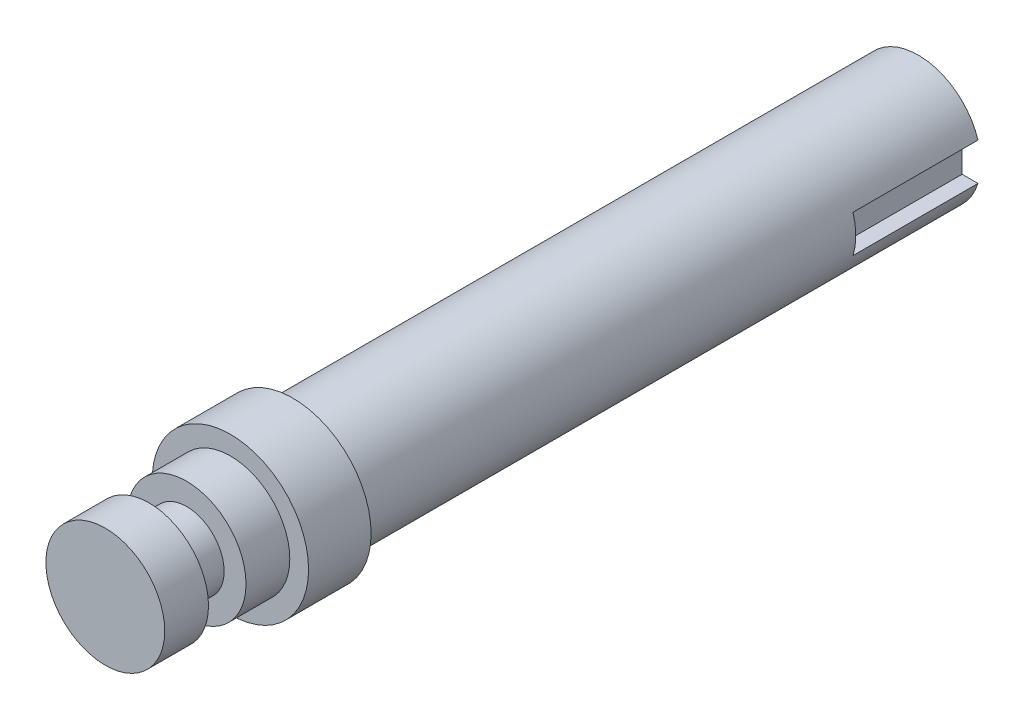
ISO-10303-21;
HEADER;
FILE_DESCRIPTION(('STEP AP214'),'2;1');
FILE_NAME('part.step','',(''),(''),'','','');
FILE_SCHEMA(('AUTOMOTIVE_DESIGN { 1 0 10303 214 1 1 1 1 }'));
ENDSEC;
DATA;
#1=APPLICATION_CONTEXT('core data for automotive mechanical design processes');
#2=APPLICATION_PROTOCOL_DEFINITION('international standard','automotive_design',2000,#1);
#3=PRODUCT_CONTEXT('',#1,'mechanical');
#4=PRODUCT('Part','Part','',(#3));
#5=PRODUCT_RELATED_PRODUCT_CATEGORY('part','',(#4));
#6=PRODUCT_DEFINITION_FORMATION('','',#4);
#7=PRODUCT_DEFINITION_CONTEXT('part definition',#1,'design');
#8=PRODUCT_DEFINITION('design','',#6,#7);
#9=PRODUCT_DEFINITION_SHAPE('','',#8);
#10=(LENGTH_UNIT() NAMED_UNIT(*) SI_UNIT(.MILLI.,.METRE.));
#11=(NAMED_UNIT(*) PLANE_ANGLE_UNIT() SI_UNIT($,.RADIAN.));
#12=(NAMED_UNIT(*) SI_UNIT($,.STERADIAN.) SOLID_ANGLE_UNIT());
#13=UNCERTAINTY_MEASURE_WITH_UNIT(LENGTH_MEASURE(1.E-05),#10,'distance_accuracy_value','');
#14=(GEOMETRIC_REPRESENTATION_CONTEXT(3) GLOBAL_UNCERTAINTY_ASSIGNED_CONTEXT((#13)) GLOBAL_UNIT_ASSIGNED_CONTEXT((#10,
#11,#12)) REPRESENTATION_CONTEXT('',''));
#15=CARTESIAN_POINT('',(0.,0.,0.));
#16=DIRECTION('',(0.,0.,1.));
#17=DIRECTION('',(1.,0.,0.));
#18=AXIS2_PLACEMENT_3D('',#15,#16,#17);
#19=CARTESIAN_POINT('',(0.,0.,100.));
#20=DIRECTION('',(0.,0.,-1.));
#21=DIRECTION('',(-1.,0.,0.));
#22=AXIS2_PLACEMENT_3D('',#19,#20,#21);
#23=CYLINDRICAL_SURFACE('',#22,10.);
#24=CARTESIAN_POINT('',(0.,0.,100.));
#25=DIRECTION('',(0.,0.,1.));
#26=DIRECTION('',(1.,0.,0.));
#27=AXIS2_PLACEMENT_3D('',#24,#25,#26);
#28=CIRCLE('',#27,10.);
#29=CARTESIAN_POINT('',(10.,0.,100.));
#30=VERTEX_POINT('',#29);
#31=EDGE_CURVE('E141',#30,#30,#28,.T.);
#32=ORIENTED_EDGE('',*,*,#31,.F.);
#33=EDGE_LOOP('',(#32));
#34=FACE_BOUND('',#33,.T.);
#35=DIRECTION('',(0.,0.,-1.));
#36=VECTOR('',#35,1.);
#37=CARTESIAN_POINT('',(9.53939201416945,-3.,100.));
#38=LINE('',#37,#36);
#39=CARTESIAN_POINT('',(9.53939201416945,-3.,20.));
#40=VERTEX_POINT('',#39);
#41=CARTESIAN_POINT('',(9.53939201416945,-3.,0.));
#42=VERTEX_POINT('',#41);
#43=EDGE_CURVE('E114',#40,#42,#38,.T.);
#44=ORIENTED_EDGE('',*,*,#43,.F.);
#45=CARTESIAN_POINT('',(0.,0.,20.));
#46=DIRECTION('',(0.,0.,-1.));
#47=DIRECTION('',(-1.,0.,0.));
#48=AXIS2_PLACEMENT_3D('',#45,#46,#47);
#49=CIRCLE('',#48,10.);
#50=CARTESIAN_POINT('',(9.53939201416945,3.,20.));
#51=VERTEX_POINT('',#50);
#52=EDGE_CURVE('E11',#51,#40,#49,.T.);
#53=ORIENTED_EDGE('',*,*,#52,.F.);
#54=DIRECTION('',(0.,0.,-1.));
#55=VECTOR('',#54,1.);
#56=CARTESIAN_POINT('',(9.53939201416945,3.,100.));
#57=LINE('',#56,#55);
#58=CARTESIAN_POINT('',(9.53939201416945,3.,0.));
#59=VERTEX_POINT('',#58);
#60=EDGE_CURVE('E92',#51,#59,#57,.T.);
#61=ORIENTED_EDGE('',*,*,#60,.T.);
#62=CARTESIAN_POINT('',(0.,0.,0.));
#63=DIRECTION('',(0.,0.,1.));
#64=DIRECTION('',(1.,0.,0.));
#65=AXIS2_PLACEMENT_3D('',#62,#63,#64);
#66=CIRCLE('',#65,10.);
#67=EDGE_CURVE('E146',#59,#42,#66,.T.);
#68=ORIENTED_EDGE('',*,*,#67,.T.);
#69=EDGE_LOOP('',(#44,#53,#61,#68));
#70=FACE_BOUND('',#69,.T.);
#71=ADVANCED_FACE('F39',(#34,#70),#23,.T.);
#72=CARTESIAN_POINT('',(0.,0.,0.));
#73=DIRECTION('',(0.,0.,1.));
#74=DIRECTION('',(1.,0.,0.));
#75=AXIS2_PLACEMENT_3D('',#72,#73,#74);
#76=PLANE('',#75);
#77=DIRECTION('',(1.,0.,0.));
#78=VECTOR('',#77,1.);
#79=CARTESIAN_POINT('',(7.,-3.,0.));
#80=LINE('',#79,#78);
#81=CARTESIAN_POINT('',(7.,-3.,0.));
#82=VERTEX_POINT('',#81);
#83=EDGE_CURVE('E97',#82,#42,#80,.T.);
#84=ORIENTED_EDGE('',*,*,#83,.T.);
#85=ORIENTED_EDGE('',*,*,#67,.F.);
#86=DIRECTION('',(1.,0.,0.));
#87=VECTOR('',#86,1.);
#88=CARTESIAN_POINT('',(7.,3.,0.));
#89=LINE('',#88,#87);
#90=CARTESIAN_POINT('',(7.,3.,0.));
#91=VERTEX_POINT('',#90);
#92=EDGE_CURVE('E101',#91,#59,#89,.T.);
#93=ORIENTED_EDGE('',*,*,#92,.F.);
#94=DIRECTION('',(0.,1.,0.));
#95=VECTOR('',#94,1.);
#96=CARTESIAN_POINT('',(7.,-3.,0.));
#97=LINE('',#96,#95);
#98=EDGE_CURVE('E54',#82,#91,#97,.T.);
#99=ORIENTED_EDGE('',*,*,#98,.F.);
#100=EDGE_LOOP('',(#84,#85,#93,#99));
#101=FACE_BOUND('',#100,.T.);
#102=ADVANCED_FACE('F158',(#101),#76,.F.);
#103=CARTESIAN_POINT('',(0.,0.,110.));
#104=DIRECTION('',(0.,0.,-1.));
#105=DIRECTION('',(-1.,0.,0.));
#106=AXIS2_PLACEMENT_3D('',#103,#104,#105);
#107=CYLINDRICAL_SURFACE('',#106,12.5);
#108=CARTESIAN_POINT('',(0.,0.,110.));
#109=DIRECTION('',(0.,0.,1.));
#110=DIRECTION('',(1.,0.,0.));
#111=AXIS2_PLACEMENT_3D('',#108,#109,#110);
#112=CIRCLE('',#111,12.5);
#113=CARTESIAN_POINT('',(12.5,0.,110.));
#114=VERTEX_POINT('',#113);
#115=EDGE_CURVE('E142',#114,#114,#112,.T.);
#116=ORIENTED_EDGE('',*,*,#115,.F.);
#117=EDGE_LOOP('',(#116));
#118=FACE_BOUND('',#117,.T.);
#119=CARTESIAN_POINT('',(0.,0.,100.));
#120=DIRECTION('',(0.,0.,1.));
#121=DIRECTION('',(1.,0.,0.));
#122=AXIS2_PLACEMENT_3D('',#119,#120,#121);
#123=CIRCLE('',#122,12.5);
#124=CARTESIAN_POINT('',(12.5,0.,100.));
#125=VERTEX_POINT('',#124);
#126=EDGE_CURVE('E137',#125,#125,#123,.T.);
#127=ORIENTED_EDGE('',*,*,#126,.T.);
#128=EDGE_LOOP('',(#127));
#129=FACE_BOUND('',#128,.T.);
#130=ADVANCED_FACE('F176',(#118,#129),#107,.T.);
#131=CARTESIAN_POINT('',(0.,0.,110.));
#132=DIRECTION('',(0.,0.,1.));
#133=DIRECTION('',(1.,0.,0.));
#134=AXIS2_PLACEMENT_3D('',#131,#132,#133);
#135=PLANE('',#134);
#136=CARTESIAN_POINT('',(0.,0.,110.));
#137=DIRECTION('',(0.,0.,1.));
#138=DIRECTION('',(1.,0.,0.));
#139=AXIS2_PLACEMENT_3D('',#136,#137,#138);
#140=CIRCLE('',#139,9.5);
#141=CARTESIAN_POINT('',(9.5,0.,110.));
#142=VERTEX_POINT('',#141);
#143=EDGE_CURVE('E133',#142,#142,#140,.T.);
#144=ORIENTED_EDGE('',*,*,#143,.F.);
#145=EDGE_LOOP('',(#144));
#146=FACE_BOUND('',#145,.T.);
#147=ORIENTED_EDGE('',*,*,#115,.T.);
#148=EDGE_LOOP('',(#147));
#149=FACE_BOUND('',#148,.T.);
#150=ADVANCED_FACE('F183',(#146,#149),#135,.T.);
#151=CARTESIAN_POINT('',(0.,0.,100.));
#152=DIRECTION('',(0.,0.,1.));
#153=DIRECTION('',(1.,0.,0.));
#154=AXIS2_PLACEMENT_3D('',#151,#152,#153);
#155=PLANE('',#154);
#156=ORIENTED_EDGE('',*,*,#31,.T.);
#157=EDGE_LOOP('',(#156));
#158=FACE_BOUND('',#157,.T.);
#159=ORIENTED_EDGE('',*,*,#126,.F.);
#160=EDGE_LOOP('',(#159));
#161=FACE_BOUND('',#160,.T.);
#162=ADVANCED_FACE('F179',(#158,#161),#155,.F.);
#163=CARTESIAN_POINT('',(0.,0.,117.));
#164=DIRECTION('',(0.,0.,-1.));
#165=DIRECTION('',(-1.,0.,0.));
#166=AXIS2_PLACEMENT_3D('',#163,#164,#165);
#167=CYLINDRICAL_SURFACE('',#166,9.5);
#168=CARTESIAN_POINT('',(0.,0.,117.));
#169=DIRECTION('',(0.,0.,1.));
#170=DIRECTION('',(1.,0.,0.));
#171=AXIS2_PLACEMENT_3D('',#168,#169,#170);
#172=CIRCLE('',#171,9.5);
#173=CARTESIAN_POINT('',(9.5,0.,117.));
#174=VERTEX_POINT('',#173);
#175=EDGE_CURVE('E129',#174,#174,#172,.T.);
#176=ORIENTED_EDGE('',*,*,#175,.F.);
#177=EDGE_LOOP('',(#176));
#178=FACE_BOUND('',#177,.T.);
#179=ORIENTED_EDGE('',*,*,#143,.T.);
#180=EDGE_LOOP('',(#179));
#181=FACE_BOUND('',#180,.T.);
#182=ADVANCED_FACE('F182',(#178,#181),#167,.T.);
#183=CARTESIAN_POINT('',(0.,0.,117.));
#184=DIRECTION('',(0.,0.,1.));
#185=DIRECTION('',(1.,0.,0.));
#186=AXIS2_PLACEMENT_3D('',#183,#184,#185);
#187=PLANE('',#186);
#188=CARTESIAN_POINT('',(0.,0.,117.));
#189=DIRECTION('',(0.,0.,1.));
#190=DIRECTION('',(1.,0.,0.));
#191=AXIS2_PLACEMENT_3D('',#188,#189,#190);
#192=CIRCLE('',#191,6.);
#193=CARTESIAN_POINT('',(6.,0.,117.));
#194=VERTEX_POINT('',#193);
#195=EDGE_CURVE('E47',#194,#194,#192,.T.);
#196=ORIENTED_EDGE('',*,*,#195,.F.);
#197=EDGE_LOOP('',(#196));
#198=FACE_BOUND('',#197,.T.);
#199=ORIENTED_EDGE('',*,*,#175,.T.);
#200=EDGE_LOOP('',(#199));
#201=FACE_BOUND('',#200,.T.);
#202=ADVANCED_FACE('F199',(#198,#201),#187,.T.);
#203=CARTESIAN_POINT('',(0.,0.,123.));
#204=DIRECTION('',(0.,0.,-1.));
#205=DIRECTION('',(-1.,0.,0.));
#206=AXIS2_PLACEMENT_3D('',#203,#204,#205);
#207=CYLINDRICAL_SURFACE('',#206,6.);
#208=CARTESIAN_POINT('',(0.,0.,123.));
#209=DIRECTION('',(0.,0.,1.));
#210=DIRECTION('',(1.,0.,0.));
#211=AXIS2_PLACEMENT_3D('',#208,#209,#210);
#212=CIRCLE('',#211,6.);
#213=CARTESIAN_POINT('',(6.,0.,123.));
#214=VERTEX_POINT('',#213);
#215=EDGE_CURVE('E122',#214,#214,#212,.T.);
#216=ORIENTED_EDGE('',*,*,#215,.F.);
#217=EDGE_LOOP('',(#216));
#218=FACE_BOUND('',#217,.T.);
#219=ORIENTED_EDGE('',*,*,#195,.T.);
#220=EDGE_LOOP('',(#219));
#221=FACE_BOUND('',#220,.T.);
#222=ADVANCED_FACE('F203',(#218,#221),#207,.T.);
#223=CARTESIAN_POINT('',(0.,0.,130.));
#224=DIRECTION('',(0.,0.,-1.));
#225=DIRECTION('',(-1.,0.,0.));
#226=AXIS2_PLACEMENT_3D('',#223,#224,#225);
#227=CYLINDRICAL_SURFACE('',#226,9.5);
#228=CARTESIAN_POINT('',(0.,0.,130.));
#229=DIRECTION('',(0.,0.,1.));
#230=DIRECTION('',(1.,0.,0.));
#231=AXIS2_PLACEMENT_3D('',#228,#229,#230);
#232=CIRCLE('',#231,9.5);
#233=CARTESIAN_POINT('',(9.5,0.,130.));
#234=VERTEX_POINT('',#233);
#235=EDGE_CURVE('E118',#234,#234,#232,.T.);
#236=ORIENTED_EDGE('',*,*,#235,.F.);
#237=EDGE_LOOP('',(#236));
#238=FACE_BOUND('',#237,.T.);
#239=CARTESIAN_POINT('',(0.,0.,123.));
#240=DIRECTION('',(0.,0.,1.));
#241=DIRECTION('',(1.,0.,0.));
#242=AXIS2_PLACEMENT_3D('',#239,#240,#241);
#243=CIRCLE('',#242,9.5);
#244=CARTESIAN_POINT('',(9.5,0.,123.));
#245=VERTEX_POINT('',#244);
#246=EDGE_CURVE('E117',#245,#245,#243,.T.);
#247=ORIENTED_EDGE('',*,*,#246,.T.);
#248=EDGE_LOOP('',(#247));
#249=FACE_BOUND('',#248,.T.);
#250=ADVANCED_FACE('F207',(#238,#249),#227,.T.);
#251=CARTESIAN_POINT('',(0.,0.,130.));
#252=DIRECTION('',(0.,0.,1.));
#253=DIRECTION('',(1.,0.,0.));
#254=AXIS2_PLACEMENT_3D('',#251,#252,#253);
#255=PLANE('',#254);
#256=ORIENTED_EDGE('',*,*,#235,.T.);
#257=EDGE_LOOP('',(#256));
#258=FACE_BOUND('',#257,.T.);
#259=ADVANCED_FACE('F211',(#258),#255,.T.);
#260=CARTESIAN_POINT('',(0.,0.,123.));
#261=DIRECTION('',(0.,0.,1.));
#262=DIRECTION('',(1.,0.,0.));
#263=AXIS2_PLACEMENT_3D('',#260,#261,#262);
#264=PLANE('',#263);
#265=ORIENTED_EDGE('',*,*,#215,.T.);
#266=EDGE_LOOP('',(#265));
#267=FACE_BOUND('',#266,.T.);
#268=ORIENTED_EDGE('',*,*,#246,.F.);
#269=EDGE_LOOP('',(#268));
#270=FACE_BOUND('',#269,.T.);
#271=ADVANCED_FACE('F169',(#267,#270),#264,.F.);
#272=CARTESIAN_POINT('',(0.,0.,20.));
#273=DIRECTION('',(0.,0.,-1.));
#274=DIRECTION('',(-1.,0.,0.));
#275=AXIS2_PLACEMENT_3D('',#272,#273,#274);
#276=PLANE('',#275);
#277=ORIENTED_EDGE('',*,*,#52,.T.);
#278=DIRECTION('',(1.,0.,0.));
#279=VECTOR('',#278,1.);
#280=CARTESIAN_POINT('',(7.,-3.,20.));
#281=LINE('',#280,#279);
#282=CARTESIAN_POINT('',(7.,-3.,20.));
#283=VERTEX_POINT('',#282);
#284=EDGE_CURVE('E87',#283,#40,#281,.T.);
#285=ORIENTED_EDGE('',*,*,#284,.F.);
#286=DIRECTION('',(0.,1.,0.));
#287=VECTOR('',#286,1.);
#288=CARTESIAN_POINT('',(7.,-3.,20.));
#289=LINE('',#288,#287);
#290=CARTESIAN_POINT('',(7.,3.,20.));
#291=VERTEX_POINT('',#290);
#292=EDGE_CURVE('E82',#283,#291,#289,.T.);
#293=ORIENTED_EDGE('',*,*,#292,.T.);
#294=DIRECTION('',(1.,0.,0.));
#295=VECTOR('',#294,1.);
#296=CARTESIAN_POINT('',(7.,3.,20.));
#297=LINE('',#296,#295);
#298=EDGE_CURVE('E89',#291,#51,#297,.T.);
#299=ORIENTED_EDGE('',*,*,#298,.T.);
#300=EDGE_LOOP('',(#277,#285,#293,#299));
#301=FACE_BOUND('',#300,.T.);
#302=ADVANCED_FACE('F95',(#301),#276,.T.);
#303=CARTESIAN_POINT('',(7.,-3.,20.));
#304=DIRECTION('',(0.,1.,0.));
#305=DIRECTION('',(-1.,0.,0.));
#306=AXIS2_PLACEMENT_3D('',#303,#304,#305);
#307=PLANE('',#306);
#308=ORIENTED_EDGE('',*,*,#43,.T.);
#309=ORIENTED_EDGE('',*,*,#83,.F.);
#310=DIRECTION('',(0.,0.,-1.));
#311=VECTOR('',#310,1.);
#312=CARTESIAN_POINT('',(7.,-3.,20.));
#313=LINE('',#312,#311);
#314=EDGE_CURVE('E86',#283,#82,#313,.T.);
#315=ORIENTED_EDGE('',*,*,#314,.F.);
#316=ORIENTED_EDGE('',*,*,#284,.T.);
#317=EDGE_LOOP('',(#308,#309,#315,#316));
#318=FACE_BOUND('',#317,.T.);
#319=ADVANCED_FACE('F161',(#318),#307,.T.);
#320=CARTESIAN_POINT('',(7.,3.,20.));
#321=DIRECTION('',(0.,1.,0.));
#322=DIRECTION('',(0.,0.,1.));
#323=AXIS2_PLACEMENT_3D('',#320,#321,#322);
#324=PLANE('',#323);
#325=ORIENTED_EDGE('',*,*,#298,.F.);
#326=DIRECTION('',(0.,0.,-1.));
#327=VECTOR('',#326,1.);
#328=CARTESIAN_POINT('',(7.,3.,20.));
#329=LINE('',#328,#327);
#330=EDGE_CURVE('E78',#291,#91,#329,.T.);
#331=ORIENTED_EDGE('',*,*,#330,.T.);
#332=ORIENTED_EDGE('',*,*,#92,.T.);
#333=ORIENTED_EDGE('',*,*,#60,.F.);
#334=EDGE_LOOP('',(#325,#331,#332,#333));
#335=FACE_BOUND('',#334,.T.);
#336=ADVANCED_FACE('F90',(#335),#324,.F.);
#337=CARTESIAN_POINT('',(7.,-3.,20.));
#338=DIRECTION('',(-1.,0.,0.));
#339=DIRECTION('',(0.,-1.,0.));
#340=AXIS2_PLACEMENT_3D('',#337,#338,#339);
#341=PLANE('',#340);
#342=ORIENTED_EDGE('',*,*,#98,.T.);
#343=ORIENTED_EDGE('',*,*,#330,.F.);
#344=ORIENTED_EDGE('',*,*,#292,.F.);
#345=ORIENTED_EDGE('',*,*,#314,.T.);
#346=EDGE_LOOP('',(#342,#343,#344,#345));
#347=FACE_BOUND('',#346,.T.);
#348=ADVANCED_FACE('F80',(#347),#341,.F.);
#349=CLOSED_SHELL('',(#71,#102,#130,#150,#162,#182,#202,#222,#250,#259,#271,#302,#319,#336,#348));
#350=MANIFOLD_SOLID_BREP('B2',#349);
#351=ADVANCED_BREP_SHAPE_REPRESENTATION('',(#18,#350),#14);
#352=SHAPE_DEFINITION_REPRESENTATION(#9,#351);
ENDSEC;
END-ISO-10303-21;
